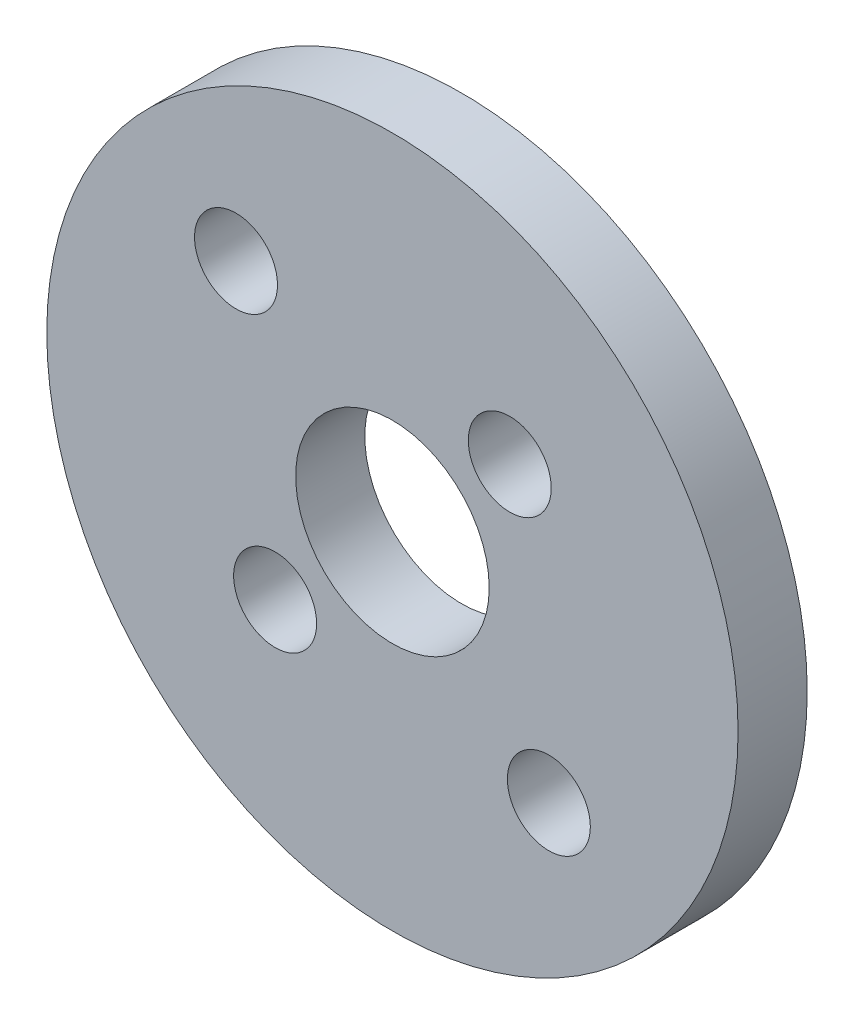
ISO-10303-21;
HEADER;
FILE_DESCRIPTION(('STEP AP214'),'2;1');
FILE_NAME('part.step','',(''),(''),'','','');
FILE_SCHEMA(('AUTOMOTIVE_DESIGN { 1 0 10303 214 1 1 1 1 }'));
ENDSEC;
DATA;
#1=APPLICATION_CONTEXT('core data for automotive mechanical design processes');
#2=APPLICATION_PROTOCOL_DEFINITION('international standard','automotive_design',2000,#1);
#3=PRODUCT_CONTEXT('',#1,'mechanical');
#4=PRODUCT('Part','Part','',(#3));
#5=PRODUCT_RELATED_PRODUCT_CATEGORY('part','',(#4));
#6=PRODUCT_DEFINITION_FORMATION('','',#4);
#7=PRODUCT_DEFINITION_CONTEXT('part definition',#1,'design');
#8=PRODUCT_DEFINITION('design','',#6,#7);
#9=PRODUCT_DEFINITION_SHAPE('','',#8);
#10=(LENGTH_UNIT() NAMED_UNIT(*) SI_UNIT(.MILLI.,.METRE.));
#11=(NAMED_UNIT(*) PLANE_ANGLE_UNIT() SI_UNIT($,.RADIAN.));
#12=(NAMED_UNIT(*) SI_UNIT($,.STERADIAN.) SOLID_ANGLE_UNIT());
#13=UNCERTAINTY_MEASURE_WITH_UNIT(LENGTH_MEASURE(1.E-05),#10,'distance_accuracy_value','');
#14=(GEOMETRIC_REPRESENTATION_CONTEXT(3) GLOBAL_UNCERTAINTY_ASSIGNED_CONTEXT((#13)) GLOBAL_UNIT_ASSIGNED_CONTEXT((#10,
#11,#12)) REPRESENTATION_CONTEXT('',''));
#15=CARTESIAN_POINT('',(0.,0.,0.));
#16=DIRECTION('',(0.,0.,1.));
#17=DIRECTION('',(1.,0.,0.));
#18=AXIS2_PLACEMENT_3D('',#15,#16,#17);
#19=CARTESIAN_POINT('',(1.49114993309272E-12,-150.000000000003,2.5));
#20=DIRECTION('',(0.,0.,1.));
#21=DIRECTION('',(1.,0.,0.));
#22=AXIS2_PLACEMENT_3D('',#19,#20,#21);
#23=PLANE('',#22);
#24=CARTESIAN_POINT('',(-4.2426406871149,-154.242640687115,2.5));
#25=DIRECTION('',(0.,0.,1.));
#26=DIRECTION('',(1.,0.,0.));
#27=AXIS2_PLACEMENT_3D('',#24,#25,#26);
#28=CIRCLE('',#27,1.5);
#29=CARTESIAN_POINT('',(-2.7426406871149,-154.242640687115,2.5));
#30=VERTEX_POINT('',#29);
#31=EDGE_CURVE('E60',#30,#30,#28,.T.);
#32=ORIENTED_EDGE('',*,*,#31,.F.);
#33=EDGE_LOOP('',(#32));
#34=FACE_BOUND('',#33,.T.);
#35=CARTESIAN_POINT('',(-5.65685424948808,-144.343145750504,2.5));
#36=DIRECTION('',(0.,0.,1.));
#37=DIRECTION('',(1.,0.,0.));
#38=AXIS2_PLACEMENT_3D('',#35,#36,#37);
#39=CIRCLE('',#38,1.5);
#40=CARTESIAN_POINT('',(-4.15685424948808,-144.343145750504,2.5));
#41=VERTEX_POINT('',#40);
#42=EDGE_CURVE('E48',#41,#41,#39,.T.);
#43=ORIENTED_EDGE('',*,*,#42,.F.);
#44=EDGE_LOOP('',(#43));
#45=FACE_BOUND('',#44,.T.);
#46=CARTESIAN_POINT('',(1.49114993309272E-12,-150.000000000003,2.5));
#47=DIRECTION('',(0.,0.,1.));
#48=DIRECTION('',(1.,0.,0.));
#49=AXIS2_PLACEMENT_3D('',#46,#47,#48);
#50=CIRCLE('',#49,12.4999999999964);
#51=CARTESIAN_POINT('',(12.4999999999979,-150.000000000003,2.5));
#52=VERTEX_POINT('',#51);
#53=EDGE_CURVE('E10',#52,#52,#50,.T.);
#54=ORIENTED_EDGE('',*,*,#53,.T.);
#55=EDGE_LOOP('',(#54));
#56=FACE_BOUND('',#55,.T.);
#57=CARTESIAN_POINT('',(5.65685424949676,-155.656854249488,2.5));
#58=DIRECTION('',(0.,0.,1.));
#59=DIRECTION('',(1.,0.,0.));
#60=AXIS2_PLACEMENT_3D('',#57,#58,#59);
#61=CIRCLE('',#60,1.5);
#62=CARTESIAN_POINT('',(7.15685424949676,-155.656854249488,2.5));
#63=VERTEX_POINT('',#62);
#64=EDGE_CURVE('E43',#63,#63,#61,.T.);
#65=ORIENTED_EDGE('',*,*,#64,.F.);
#66=EDGE_LOOP('',(#65));
#67=FACE_BOUND('',#66,.T.);
#68=CARTESIAN_POINT('',(4.24264068712358,-145.757359312877,2.5));
#69=DIRECTION('',(0.,0.,1.));
#70=DIRECTION('',(1.,0.,0.));
#71=AXIS2_PLACEMENT_3D('',#68,#69,#70);
#72=CIRCLE('',#71,1.5);
#73=CARTESIAN_POINT('',(5.74264068712358,-145.757359312877,2.5));
#74=VERTEX_POINT('',#73);
#75=EDGE_CURVE('E54',#74,#74,#72,.T.);
#76=ORIENTED_EDGE('',*,*,#75,.F.);
#77=EDGE_LOOP('',(#76));
#78=FACE_BOUND('',#77,.T.);
#79=CARTESIAN_POINT('',(1.49114993309272E-12,-150.000000000003,2.5));
#80=DIRECTION('',(0.,0.,1.));
#81=DIRECTION('',(1.,0.,0.));
#82=AXIS2_PLACEMENT_3D('',#79,#80,#81);
#83=CIRCLE('',#82,3.49999999999797);
#84=CARTESIAN_POINT('',(3.49999999999946,-150.000000000003,2.5));
#85=VERTEX_POINT('',#84);
#86=EDGE_CURVE('E66',#85,#85,#83,.T.);
#87=ORIENTED_EDGE('',*,*,#86,.F.);
#88=EDGE_LOOP('',(#87));
#89=FACE_BOUND('',#88,.T.);
#90=ADVANCED_FACE('F32',(#34,#45,#56,#67,#78,#89),#23,.T.);
#91=CARTESIAN_POINT('',(1.49114993309272E-12,-150.000000000003,0.));
#92=DIRECTION('',(0.,0.,1.));
#93=DIRECTION('',(1.,0.,0.));
#94=AXIS2_PLACEMENT_3D('',#91,#92,#93);
#95=PLANE('',#94);
#96=CARTESIAN_POINT('',(1.49114993309272E-12,-150.000000000003,0.));
#97=DIRECTION('',(0.,0.,1.));
#98=DIRECTION('',(1.,0.,0.));
#99=AXIS2_PLACEMENT_3D('',#96,#97,#98);
#100=CIRCLE('',#99,12.4999999999964);
#101=CARTESIAN_POINT('',(12.4999999999979,-150.000000000003,0.));
#102=VERTEX_POINT('',#101);
#103=EDGE_CURVE('E36',#102,#102,#100,.T.);
#104=ORIENTED_EDGE('',*,*,#103,.F.);
#105=EDGE_LOOP('',(#104));
#106=FACE_BOUND('',#105,.T.);
#107=CARTESIAN_POINT('',(5.65685424949676,-155.656854249488,0.));
#108=DIRECTION('',(0.,0.,1.));
#109=DIRECTION('',(1.,0.,0.));
#110=AXIS2_PLACEMENT_3D('',#107,#108,#109);
#111=CIRCLE('',#110,1.5);
#112=CARTESIAN_POINT('',(7.15685424949676,-155.656854249488,0.));
#113=VERTEX_POINT('',#112);
#114=EDGE_CURVE('E45',#113,#113,#111,.T.);
#115=ORIENTED_EDGE('',*,*,#114,.T.);
#116=EDGE_LOOP('',(#115));
#117=FACE_BOUND('',#116,.T.);
#118=CARTESIAN_POINT('',(-5.65685424948808,-144.343145750504,0.));
#119=DIRECTION('',(0.,0.,1.));
#120=DIRECTION('',(1.,0.,0.));
#121=AXIS2_PLACEMENT_3D('',#118,#119,#120);
#122=CIRCLE('',#121,1.5);
#123=CARTESIAN_POINT('',(-4.15685424948808,-144.343145750504,0.));
#124=VERTEX_POINT('',#123);
#125=EDGE_CURVE('E51',#124,#124,#122,.T.);
#126=ORIENTED_EDGE('',*,*,#125,.T.);
#127=EDGE_LOOP('',(#126));
#128=FACE_BOUND('',#127,.T.);
#129=CARTESIAN_POINT('',(4.24264068712358,-145.757359312877,0.));
#130=DIRECTION('',(0.,0.,1.));
#131=DIRECTION('',(1.,0.,0.));
#132=AXIS2_PLACEMENT_3D('',#129,#130,#131);
#133=CIRCLE('',#132,1.5);
#134=CARTESIAN_POINT('',(5.74264068712358,-145.757359312877,0.));
#135=VERTEX_POINT('',#134);
#136=EDGE_CURVE('E57',#135,#135,#133,.T.);
#137=ORIENTED_EDGE('',*,*,#136,.T.);
#138=EDGE_LOOP('',(#137));
#139=FACE_BOUND('',#138,.T.);
#140=CARTESIAN_POINT('',(-4.2426406871149,-154.242640687115,0.));
#141=DIRECTION('',(0.,0.,1.));
#142=DIRECTION('',(1.,0.,0.));
#143=AXIS2_PLACEMENT_3D('',#140,#141,#142);
#144=CIRCLE('',#143,1.5);
#145=CARTESIAN_POINT('',(-2.7426406871149,-154.242640687115,0.));
#146=VERTEX_POINT('',#145);
#147=EDGE_CURVE('E63',#146,#146,#144,.T.);
#148=ORIENTED_EDGE('',*,*,#147,.T.);
#149=EDGE_LOOP('',(#148));
#150=FACE_BOUND('',#149,.T.);
#151=CARTESIAN_POINT('',(1.49114993309272E-12,-150.000000000003,0.));
#152=DIRECTION('',(0.,0.,1.));
#153=DIRECTION('',(1.,0.,0.));
#154=AXIS2_PLACEMENT_3D('',#151,#152,#153);
#155=CIRCLE('',#154,3.49999999999797);
#156=CARTESIAN_POINT('',(3.49999999999946,-150.000000000003,0.));
#157=VERTEX_POINT('',#156);
#158=EDGE_CURVE('E69',#157,#157,#155,.T.);
#159=ORIENTED_EDGE('',*,*,#158,.T.);
#160=EDGE_LOOP('',(#159));
#161=FACE_BOUND('',#160,.T.);
#162=ADVANCED_FACE('F79',(#106,#117,#128,#139,#150,#161),#95,.F.);
#163=CARTESIAN_POINT('',(1.49114993309272E-12,-150.000000000003,2.5));
#164=DIRECTION('',(0.,0.,-1.));
#165=DIRECTION('',(-1.,0.,0.));
#166=AXIS2_PLACEMENT_3D('',#163,#164,#165);
#167=CYLINDRICAL_SURFACE('',#166,12.4999999999964);
#168=ORIENTED_EDGE('',*,*,#53,.F.);
#169=EDGE_LOOP('',(#168));
#170=FACE_BOUND('',#169,.T.);
#171=ORIENTED_EDGE('',*,*,#103,.T.);
#172=EDGE_LOOP('',(#171));
#173=FACE_BOUND('',#172,.T.);
#174=ADVANCED_FACE('F34',(#170,#173),#167,.T.);
#175=CARTESIAN_POINT('',(5.65685424949676,-155.656854249488,2.5));
#176=DIRECTION('',(0.,0.,-1.));
#177=DIRECTION('',(-1.,0.,0.));
#178=AXIS2_PLACEMENT_3D('',#175,#176,#177);
#179=CYLINDRICAL_SURFACE('',#178,1.5);
#180=ORIENTED_EDGE('',*,*,#64,.T.);
#181=EDGE_LOOP('',(#180));
#182=FACE_BOUND('',#181,.T.);
#183=ORIENTED_EDGE('',*,*,#114,.F.);
#184=EDGE_LOOP('',(#183));
#185=FACE_BOUND('',#184,.T.);
#186=ADVANCED_FACE('F89',(#182,#185),#179,.F.);
#187=CARTESIAN_POINT('',(-5.65685424948808,-144.343145750504,2.5));
#188=DIRECTION('',(0.,0.,-1.));
#189=DIRECTION('',(-1.,0.,0.));
#190=AXIS2_PLACEMENT_3D('',#187,#188,#189);
#191=CYLINDRICAL_SURFACE('',#190,1.5);
#192=ORIENTED_EDGE('',*,*,#42,.T.);
#193=EDGE_LOOP('',(#192));
#194=FACE_BOUND('',#193,.T.);
#195=ORIENTED_EDGE('',*,*,#125,.F.);
#196=EDGE_LOOP('',(#195));
#197=FACE_BOUND('',#196,.T.);
#198=ADVANCED_FACE('F92',(#194,#197),#191,.F.);
#199=CARTESIAN_POINT('',(4.24264068712358,-145.757359312877,2.5));
#200=DIRECTION('',(0.,0.,-1.));
#201=DIRECTION('',(-1.,0.,0.));
#202=AXIS2_PLACEMENT_3D('',#199,#200,#201);
#203=CYLINDRICAL_SURFACE('',#202,1.5);
#204=ORIENTED_EDGE('',*,*,#75,.T.);
#205=EDGE_LOOP('',(#204));
#206=FACE_BOUND('',#205,.T.);
#207=ORIENTED_EDGE('',*,*,#136,.F.);
#208=EDGE_LOOP('',(#207));
#209=FACE_BOUND('',#208,.T.);
#210=ADVANCED_FACE('F96',(#206,#209),#203,.F.);
#211=CARTESIAN_POINT('',(-4.2426406871149,-154.242640687115,2.5));
#212=DIRECTION('',(0.,0.,-1.));
#213=DIRECTION('',(-1.,0.,0.));
#214=AXIS2_PLACEMENT_3D('',#211,#212,#213);
#215=CYLINDRICAL_SURFACE('',#214,1.5);
#216=ORIENTED_EDGE('',*,*,#31,.T.);
#217=EDGE_LOOP('',(#216));
#218=FACE_BOUND('',#217,.T.);
#219=ORIENTED_EDGE('',*,*,#147,.F.);
#220=EDGE_LOOP('',(#219));
#221=FACE_BOUND('',#220,.T.);
#222=ADVANCED_FACE('F100',(#218,#221),#215,.F.);
#223=CARTESIAN_POINT('',(1.49114993309272E-12,-150.000000000003,2.5));
#224=DIRECTION('',(0.,0.,-1.));
#225=DIRECTION('',(-1.,0.,0.));
#226=AXIS2_PLACEMENT_3D('',#223,#224,#225);
#227=CYLINDRICAL_SURFACE('',#226,3.49999999999797);
#228=ORIENTED_EDGE('',*,*,#86,.T.);
#229=EDGE_LOOP('',(#228));
#230=FACE_BOUND('',#229,.T.);
#231=ORIENTED_EDGE('',*,*,#158,.F.);
#232=EDGE_LOOP('',(#231));
#233=FACE_BOUND('',#232,.T.);
#234=ADVANCED_FACE('F75',(#230,#233),#227,.F.);
#235=CLOSED_SHELL('',(#90,#162,#174,#186,#198,#210,#222,#234));
#236=MANIFOLD_SOLID_BREP('B2',#235);
#237=ADVANCED_BREP_SHAPE_REPRESENTATION('',(#18,#236),#14);
#238=SHAPE_DEFINITION_REPRESENTATION(#9,#237);
ENDSEC;
END-ISO-10303-21;
